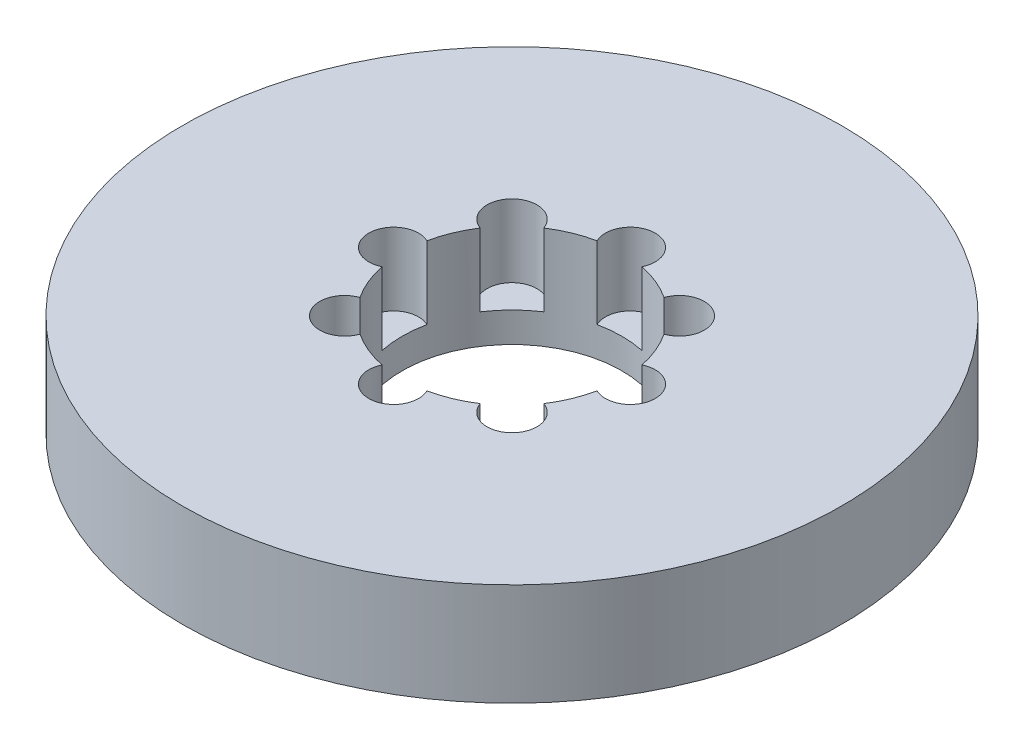
ISO-10303-21;
HEADER;
FILE_DESCRIPTION(('STEP AP214'),'2;1');
FILE_NAME('part.step','',(''),(''),'','','');
FILE_SCHEMA(('AUTOMOTIVE_DESIGN { 1 0 10303 214 1 1 1 1 }'));
ENDSEC;
DATA;
#1=APPLICATION_CONTEXT('core data for automotive mechanical design processes');
#2=APPLICATION_PROTOCOL_DEFINITION('international standard','automotive_design',2000,#1);
#3=PRODUCT_CONTEXT('',#1,'mechanical');
#4=PRODUCT('Part','Part','',(#3));
#5=PRODUCT_RELATED_PRODUCT_CATEGORY('part','',(#4));
#6=PRODUCT_DEFINITION_FORMATION('','',#4);
#7=PRODUCT_DEFINITION_CONTEXT('part definition',#1,'design');
#8=PRODUCT_DEFINITION('design','',#6,#7);
#9=PRODUCT_DEFINITION_SHAPE('','',#8);
#10=(LENGTH_UNIT() NAMED_UNIT(*) SI_UNIT(.MILLI.,.METRE.));
#11=(NAMED_UNIT(*) PLANE_ANGLE_UNIT() SI_UNIT($,.RADIAN.));
#12=(NAMED_UNIT(*) SI_UNIT($,.STERADIAN.) SOLID_ANGLE_UNIT());
#13=UNCERTAINTY_MEASURE_WITH_UNIT(LENGTH_MEASURE(1.E-05),#10,'distance_accuracy_value','');
#14=(GEOMETRIC_REPRESENTATION_CONTEXT(3) GLOBAL_UNCERTAINTY_ASSIGNED_CONTEXT((#13)) GLOBAL_UNIT_ASSIGNED_CONTEXT((#10,
#11,#12)) REPRESENTATION_CONTEXT('',''));
#15=CARTESIAN_POINT('',(0.,0.,0.));
#16=DIRECTION('',(0.,0.,1.));
#17=DIRECTION('',(1.,0.,0.));
#18=AXIS2_PLACEMENT_3D('',#15,#16,#17);
#19=CARTESIAN_POINT('',(0.,28.,0.));
#20=DIRECTION('',(0.,-1.,0.));
#21=DIRECTION('',(0.,0.,-1.));
#22=AXIS2_PLACEMENT_3D('',#19,#20,#21);
#23=CYLINDRICAL_SURFACE('',#22,90.);
#24=CARTESIAN_POINT('',(0.,28.,0.));
#25=DIRECTION('',(0.,1.,0.));
#26=DIRECTION('',(0.,0.,1.));
#27=AXIS2_PLACEMENT_3D('',#24,#25,#26);
#28=CIRCLE('',#27,90.);
#29=CARTESIAN_POINT('',(0.,28.,90.));
#30=VERTEX_POINT('',#29);
#31=EDGE_CURVE('E195',#30,#30,#28,.T.);
#32=ORIENTED_EDGE('',*,*,#31,.F.);
#33=EDGE_LOOP('',(#32));
#34=FACE_BOUND('',#33,.T.);
#35=CARTESIAN_POINT('',(0.,0.,0.));
#36=DIRECTION('',(0.,1.,0.));
#37=DIRECTION('',(0.,0.,1.));
#38=AXIS2_PLACEMENT_3D('',#35,#36,#37);
#39=CIRCLE('',#38,90.);
#40=CARTESIAN_POINT('',(0.,0.,90.));
#41=VERTEX_POINT('',#40);
#42=EDGE_CURVE('E179',#41,#41,#39,.T.);
#43=ORIENTED_EDGE('',*,*,#42,.T.);
#44=EDGE_LOOP('',(#43));
#45=FACE_BOUND('',#44,.T.);
#46=ADVANCED_FACE('F39',(#34,#45),#23,.T.);
#47=CARTESIAN_POINT('',(0.,28.,0.));
#48=DIRECTION('',(0.,1.,0.));
#49=DIRECTION('',(0.,0.,1.));
#50=AXIS2_PLACEMENT_3D('',#47,#48,#49);
#51=PLANE('',#50);
#52=CARTESIAN_POINT('',(1.12819682077759E-13,28.,32.3128412065752));
#53=DIRECTION('',(0.,1.,0.));
#54=DIRECTION('',(1.,0.,0.));
#55=AXIS2_PLACEMENT_3D('',#52,#53,#54);
#56=CIRCLE('',#55,6.80914139712923);
#57=CARTESIAN_POINT('',(-6.13813148406633,28.,29.3653425296609));
#58=VERTEX_POINT('',#57);
#59=CARTESIAN_POINT('',(6.13813148406654,28.,29.3653425296609));
#60=VERTEX_POINT('',#59);
#61=EDGE_CURVE('E176',#58,#60,#56,.T.);
#62=ORIENTED_EDGE('',*,*,#61,.F.);
#63=CARTESIAN_POINT('',(0.,28.,0.));
#64=DIRECTION('',(0.,1.,0.));
#65=DIRECTION('',(0.,0.,1.));
#66=AXIS2_PLACEMENT_3D('',#63,#64,#65);
#67=CIRCLE('',#66,30.);
#68=CARTESIAN_POINT('',(-16.4241184383909,28.,25.104747230787));
#69=VERTEX_POINT('',#68);
#70=EDGE_CURVE('E166',#69,#58,#67,.T.);
#71=ORIENTED_EDGE('',*,*,#70,.F.);
#72=CARTESIAN_POINT('',(-22.8486291365734,28.,22.8486291365735));
#73=DIRECTION('',(0.,1.,0.));
#74=DIRECTION('',(0.707106781186549,0.,0.707106781186546));
#75=AXIS2_PLACEMENT_3D('',#72,#73,#74);
#76=CIRCLE('',#75,6.80914139712923);
#77=CARTESIAN_POINT('',(-25.104747230787,28.,16.424118438391));
#78=VERTEX_POINT('',#77);
#79=EDGE_CURVE('E147',#78,#69,#76,.T.);
#80=ORIENTED_EDGE('',*,*,#79,.F.);
#81=CARTESIAN_POINT('',(-29.3653425296609,28.,6.13813148406643));
#82=VERTEX_POINT('',#81);
#83=EDGE_CURVE('E180',#82,#78,#67,.T.);
#84=ORIENTED_EDGE('',*,*,#83,.F.);
#85=CARTESIAN_POINT('',(-32.3128412065752,28.,0.));
#86=DIRECTION('',(0.,1.,0.));
#87=DIRECTION('',(0.,0.,1.));
#88=AXIS2_PLACEMENT_3D('',#85,#86,#87);
#89=CIRCLE('',#88,6.80914139712923);
#90=CARTESIAN_POINT('',(-29.3653425296609,28.,-6.13813148406643));
#91=VERTEX_POINT('',#90);
#92=EDGE_CURVE('E186',#91,#82,#89,.T.);
#93=ORIENTED_EDGE('',*,*,#92,.F.);
#94=CARTESIAN_POINT('',(-25.1047472307872,28.,-16.4241184383906));
#95=VERTEX_POINT('',#94);
#96=EDGE_CURVE('E182',#95,#91,#67,.T.);
#97=ORIENTED_EDGE('',*,*,#96,.F.);
#98=CARTESIAN_POINT('',(-22.8486291365737,28.,-22.8486291365731));
#99=DIRECTION('',(0.,1.,0.));
#100=DIRECTION('',(-0.707106781186539,0.,0.707106781186556));
#101=AXIS2_PLACEMENT_3D('',#98,#99,#100);
#102=CIRCLE('',#101,6.80914139712923);
#103=CARTESIAN_POINT('',(-16.4241184383912,28.,-25.1047472307868));
#104=VERTEX_POINT('',#103);
#105=EDGE_CURVE('E446',#104,#95,#102,.T.);
#106=ORIENTED_EDGE('',*,*,#105,.F.);
#107=CARTESIAN_POINT('',(-6.13813148406674,28.,-29.3653425296609));
#108=VERTEX_POINT('',#107);
#109=EDGE_CURVE('E452',#108,#104,#67,.T.);
#110=ORIENTED_EDGE('',*,*,#109,.F.);
#111=CARTESIAN_POINT('',(-3.38459046233276E-13,28.,-32.3128412065752));
#112=DIRECTION('',(0.,1.,0.));
#113=DIRECTION('',(-1.,0.,0.));
#114=AXIS2_PLACEMENT_3D('',#111,#112,#113);
#115=CIRCLE('',#114,6.80914139712923);
#116=CARTESIAN_POINT('',(6.13813148406613,28.,-29.365342529661));
#117=VERTEX_POINT('',#116);
#118=EDGE_CURVE('E477',#117,#108,#115,.T.);
#119=ORIENTED_EDGE('',*,*,#118,.F.);
#120=CARTESIAN_POINT('',(16.4241184383907,28.,-25.1047472307871));
#121=VERTEX_POINT('',#120);
#122=EDGE_CURVE('E460',#121,#117,#67,.T.);
#123=ORIENTED_EDGE('',*,*,#122,.F.);
#124=CARTESIAN_POINT('',(22.8486291365732,28.,-22.8486291365736));
#125=DIRECTION('',(0.,1.,0.));
#126=DIRECTION('',(-0.707106781186554,0.,-0.707106781186541));
#127=AXIS2_PLACEMENT_3D('',#124,#125,#126);
#128=CIRCLE('',#127,6.80914139712923);
#129=CARTESIAN_POINT('',(25.1047472307868,28.,-16.4241184383912));
#130=VERTEX_POINT('',#129);
#131=EDGE_CURVE('E464',#130,#121,#128,.T.);
#132=ORIENTED_EDGE('',*,*,#131,.F.);
#133=CARTESIAN_POINT('',(29.3653425296609,28.,-6.13813148406643));
#134=VERTEX_POINT('',#133);
#135=EDGE_CURVE('E459',#134,#130,#67,.T.);
#136=ORIENTED_EDGE('',*,*,#135,.F.);
#137=CARTESIAN_POINT('',(32.3128412065752,28.,0.));
#138=DIRECTION('',(0.,1.,0.));
#139=DIRECTION('',(0.,0.,-1.));
#140=AXIS2_PLACEMENT_3D('',#137,#138,#139);
#141=CIRCLE('',#140,6.80914139712923);
#142=CARTESIAN_POINT('',(29.3653425296609,28.,6.13813148406643));
#143=VERTEX_POINT('',#142);
#144=EDGE_CURVE('E469',#143,#134,#141,.T.);
#145=ORIENTED_EDGE('',*,*,#144,.F.);
#146=CARTESIAN_POINT('',(25.1047472307871,28.,16.4241184383908));
#147=VERTEX_POINT('',#146);
#148=EDGE_CURVE('E181',#147,#143,#67,.T.);
#149=ORIENTED_EDGE('',*,*,#148,.F.);
#150=CARTESIAN_POINT('',(22.8486291365735,28.,22.8486291365733));
#151=DIRECTION('',(0.,1.,0.));
#152=DIRECTION('',(0.707106781186544,0.,-0.707106781186551));
#153=AXIS2_PLACEMENT_3D('',#150,#151,#152);
#154=CIRCLE('',#153,6.80914139712923);
#155=CARTESIAN_POINT('',(16.4241184383911,28.,25.1047472307869));
#156=VERTEX_POINT('',#155);
#157=EDGE_CURVE('E475',#156,#147,#154,.T.);
#158=ORIENTED_EDGE('',*,*,#157,.F.);
#159=EDGE_CURVE('E177',#60,#156,#67,.T.);
#160=ORIENTED_EDGE('',*,*,#159,.F.);
#161=EDGE_LOOP('',(#62,#71,#80,#84,#93,#97,#106,#110,#119,#123,#132,#136,#145,#149,#158,#160));
#162=FACE_BOUND('',#161,.T.);
#163=ORIENTED_EDGE('',*,*,#31,.T.);
#164=EDGE_LOOP('',(#163));
#165=FACE_BOUND('',#164,.T.);
#166=ADVANCED_FACE('F172',(#162,#165),#51,.T.);
#167=CARTESIAN_POINT('',(0.,0.,0.));
#168=DIRECTION('',(0.,1.,0.));
#169=DIRECTION('',(0.,0.,1.));
#170=AXIS2_PLACEMENT_3D('',#167,#168,#169);
#171=PLANE('',#170);
#172=CARTESIAN_POINT('',(0.,0.,0.));
#173=DIRECTION('',(0.,1.,0.));
#174=DIRECTION('',(0.,0.,1.));
#175=AXIS2_PLACEMENT_3D('',#172,#173,#174);
#176=CIRCLE('',#175,30.);
#177=CARTESIAN_POINT('',(0.,0.,30.));
#178=VERTEX_POINT('',#177);
#179=EDGE_CURVE('E187',#178,#178,#176,.T.);
#180=ORIENTED_EDGE('',*,*,#179,.T.);
#181=EDGE_LOOP('',(#180));
#182=FACE_BOUND('',#181,.T.);
#183=ORIENTED_EDGE('',*,*,#42,.F.);
#184=EDGE_LOOP('',(#183));
#185=FACE_BOUND('',#184,.T.);
#186=ADVANCED_FACE('F270',(#182,#185),#171,.F.);
#187=CARTESIAN_POINT('',(0.,28.,0.));
#188=DIRECTION('',(0.,-1.,0.));
#189=DIRECTION('',(0.,0.,-1.));
#190=AXIS2_PLACEMENT_3D('',#187,#188,#189);
#191=CYLINDRICAL_SURFACE('',#190,30.);
#192=DIRECTION('',(0.,1.,0.));
#193=VECTOR('',#192,1.);
#194=CARTESIAN_POINT('',(-6.13813148406633,18.0872458032256,29.3653425296609));
#195=LINE('',#194,#193);
#196=CARTESIAN_POINT('',(-6.13813148406633,8.17449160645118,29.3653425296609));
#197=VERTEX_POINT('',#196);
#198=EDGE_CURVE('E11',#197,#58,#195,.T.);
#199=ORIENTED_EDGE('',*,*,#198,.F.);
#200=CARTESIAN_POINT('',(0.,8.17449160645118,0.));
#201=DIRECTION('',(0.,1.,0.));
#202=DIRECTION('',(0.,0.,1.));
#203=AXIS2_PLACEMENT_3D('',#200,#201,#202);
#204=CIRCLE('',#203,30.);
#205=CARTESIAN_POINT('',(6.13813148406654,8.17449160645118,29.3653425296609));
#206=VERTEX_POINT('',#205);
#207=EDGE_CURVE('E250',#197,#206,#204,.T.);
#208=ORIENTED_EDGE('',*,*,#207,.T.);
#209=DIRECTION('',(0.,1.,0.));
#210=VECTOR('',#209,1.);
#211=CARTESIAN_POINT('',(6.13813148406654,18.0872458032256,29.3653425296609));
#212=LINE('',#211,#210);
#213=EDGE_CURVE('E46',#60,#206,#212,.F.);
#214=ORIENTED_EDGE('',*,*,#213,.F.);
#215=ORIENTED_EDGE('',*,*,#159,.T.);
#216=DIRECTION('',(0.,1.,0.));
#217=VECTOR('',#216,1.);
#218=CARTESIAN_POINT('',(16.4241184383911,18.0872458032256,25.1047472307869));
#219=LINE('',#218,#217);
#220=CARTESIAN_POINT('',(16.4241184383911,8.17449160645118,25.1047472307869));
#221=VERTEX_POINT('',#220);
#222=EDGE_CURVE('E244',#221,#156,#219,.T.);
#223=ORIENTED_EDGE('',*,*,#222,.F.);
#224=CARTESIAN_POINT('',(0.,8.17449160645118,0.));
#225=DIRECTION('',(0.,1.,0.));
#226=DIRECTION('',(0.,0.,1.));
#227=AXIS2_PLACEMENT_3D('',#224,#225,#226);
#228=CIRCLE('',#227,30.);
#229=CARTESIAN_POINT('',(25.1047472307871,8.17449160645118,16.4241184383908));
#230=VERTEX_POINT('',#229);
#231=EDGE_CURVE('E238',#221,#230,#228,.T.);
#232=ORIENTED_EDGE('',*,*,#231,.T.);
#233=DIRECTION('',(0.,1.,0.));
#234=VECTOR('',#233,1.);
#235=CARTESIAN_POINT('',(25.1047472307871,18.0872458032256,16.4241184383908));
#236=LINE('',#235,#234);
#237=EDGE_CURVE('E242',#147,#230,#236,.F.);
#238=ORIENTED_EDGE('',*,*,#237,.F.);
#239=ORIENTED_EDGE('',*,*,#148,.T.);
#240=DIRECTION('',(0.,1.,0.));
#241=VECTOR('',#240,1.);
#242=CARTESIAN_POINT('',(29.3653425296609,18.0872458032256,6.13813148406644));
#243=LINE('',#242,#241);
#244=CARTESIAN_POINT('',(29.3653425296609,8.17449160645118,6.13813148406643));
#245=VERTEX_POINT('',#244);
#246=EDGE_CURVE('E236',#245,#143,#243,.T.);
#247=ORIENTED_EDGE('',*,*,#246,.F.);
#248=CARTESIAN_POINT('',(0.,8.17449160645118,0.));
#249=DIRECTION('',(0.,1.,0.));
#250=DIRECTION('',(0.,0.,1.));
#251=AXIS2_PLACEMENT_3D('',#248,#249,#250);
#252=CIRCLE('',#251,30.);
#253=CARTESIAN_POINT('',(29.3653425296609,8.17449160645118,-6.13813148406643));
#254=VERTEX_POINT('',#253);
#255=EDGE_CURVE('E235',#245,#254,#252,.T.);
#256=ORIENTED_EDGE('',*,*,#255,.T.);
#257=DIRECTION('',(0.,1.,0.));
#258=VECTOR('',#257,1.);
#259=CARTESIAN_POINT('',(29.3653425296609,18.0872458032256,-6.13813148406644));
#260=LINE('',#259,#258);
#261=EDGE_CURVE('E234',#134,#254,#260,.F.);
#262=ORIENTED_EDGE('',*,*,#261,.F.);
#263=ORIENTED_EDGE('',*,*,#135,.T.);
#264=DIRECTION('',(0.,1.,0.));
#265=VECTOR('',#264,1.);
#266=CARTESIAN_POINT('',(25.1047472307868,18.0872458032256,-16.4241184383912));
#267=LINE('',#266,#265);
#268=CARTESIAN_POINT('',(25.1047472307868,8.17449160645118,-16.4241184383912));
#269=VERTEX_POINT('',#268);
#270=EDGE_CURVE('E229',#269,#130,#267,.T.);
#271=ORIENTED_EDGE('',*,*,#270,.F.);
#272=CARTESIAN_POINT('',(0.,8.17449160645118,0.));
#273=DIRECTION('',(0.,1.,0.));
#274=DIRECTION('',(0.,0.,1.));
#275=AXIS2_PLACEMENT_3D('',#272,#273,#274);
#276=CIRCLE('',#275,30.);
#277=CARTESIAN_POINT('',(16.4241184383907,8.17449160645118,-25.1047472307871));
#278=VERTEX_POINT('',#277);
#279=EDGE_CURVE('E221',#269,#278,#276,.T.);
#280=ORIENTED_EDGE('',*,*,#279,.T.);
#281=DIRECTION('',(0.,1.,0.));
#282=VECTOR('',#281,1.);
#283=CARTESIAN_POINT('',(16.4241184383907,18.0872458032256,-25.1047472307871));
#284=LINE('',#283,#282);
#285=EDGE_CURVE('E230',#121,#278,#284,.F.);
#286=ORIENTED_EDGE('',*,*,#285,.F.);
#287=ORIENTED_EDGE('',*,*,#122,.T.);
#288=DIRECTION('',(0.,1.,0.));
#289=VECTOR('',#288,1.);
#290=CARTESIAN_POINT('',(6.13813148406613,18.0872458032256,-29.365342529661));
#291=LINE('',#290,#289);
#292=CARTESIAN_POINT('',(6.13813148406613,8.17449160645118,-29.365342529661));
#293=VERTEX_POINT('',#292);
#294=EDGE_CURVE('E225',#293,#117,#291,.T.);
#295=ORIENTED_EDGE('',*,*,#294,.F.);
#296=CARTESIAN_POINT('',(0.,8.17449160645118,0.));
#297=DIRECTION('',(0.,1.,0.));
#298=DIRECTION('',(0.,0.,1.));
#299=AXIS2_PLACEMENT_3D('',#296,#297,#298);
#300=CIRCLE('',#299,30.);
#301=CARTESIAN_POINT('',(-6.13813148406674,8.17449160645118,-29.3653425296609));
#302=VERTEX_POINT('',#301);
#303=EDGE_CURVE('E216',#293,#302,#300,.T.);
#304=ORIENTED_EDGE('',*,*,#303,.T.);
#305=DIRECTION('',(0.,1.,0.));
#306=VECTOR('',#305,1.);
#307=CARTESIAN_POINT('',(-6.13813148406674,18.0872458032256,-29.3653425296609));
#308=LINE('',#307,#306);
#309=EDGE_CURVE('E218',#108,#302,#308,.F.);
#310=ORIENTED_EDGE('',*,*,#309,.F.);
#311=ORIENTED_EDGE('',*,*,#109,.T.);
#312=DIRECTION('',(0.,1.,0.));
#313=VECTOR('',#312,1.);
#314=CARTESIAN_POINT('',(-16.4241184383912,18.0872458032256,-25.1047472307868));
#315=LINE('',#314,#313);
#316=CARTESIAN_POINT('',(-16.4241184383912,8.17449160645118,-25.1047472307868));
#317=VERTEX_POINT('',#316);
#318=EDGE_CURVE('E212',#317,#104,#315,.T.);
#319=ORIENTED_EDGE('',*,*,#318,.F.);
#320=CARTESIAN_POINT('',(0.,8.17449160645118,0.));
#321=DIRECTION('',(0.,1.,0.));
#322=DIRECTION('',(0.,0.,1.));
#323=AXIS2_PLACEMENT_3D('',#320,#321,#322);
#324=CIRCLE('',#323,30.);
#325=CARTESIAN_POINT('',(-25.1047472307872,8.17449160645118,-16.4241184383906));
#326=VERTEX_POINT('',#325);
#327=EDGE_CURVE('E208',#317,#326,#324,.T.);
#328=ORIENTED_EDGE('',*,*,#327,.T.);
#329=DIRECTION('',(0.,1.,0.));
#330=VECTOR('',#329,1.);
#331=CARTESIAN_POINT('',(-25.1047472307872,18.0872458032256,-16.4241184383906));
#332=LINE('',#331,#330);
#333=EDGE_CURVE('E211',#95,#326,#332,.F.);
#334=ORIENTED_EDGE('',*,*,#333,.F.);
#335=ORIENTED_EDGE('',*,*,#96,.T.);
#336=DIRECTION('',(0.,1.,0.));
#337=VECTOR('',#336,1.);
#338=CARTESIAN_POINT('',(-29.3653425296609,18.0872458032256,-6.13813148406644));
#339=LINE('',#338,#337);
#340=CARTESIAN_POINT('',(-29.3653425296609,8.17449160645118,-6.13813148406643));
#341=VERTEX_POINT('',#340);
#342=EDGE_CURVE('E201',#341,#91,#339,.T.);
#343=ORIENTED_EDGE('',*,*,#342,.F.);
#344=CARTESIAN_POINT('',(0.,8.17449160645118,0.));
#345=DIRECTION('',(0.,1.,0.));
#346=DIRECTION('',(0.,0.,1.));
#347=AXIS2_PLACEMENT_3D('',#344,#345,#346);
#348=CIRCLE('',#347,30.);
#349=CARTESIAN_POINT('',(-29.3653425296609,8.17449160645118,6.13813148406643));
#350=VERTEX_POINT('',#349);
#351=EDGE_CURVE('E194',#341,#350,#348,.T.);
#352=ORIENTED_EDGE('',*,*,#351,.T.);
#353=DIRECTION('',(0.,1.,0.));
#354=VECTOR('',#353,1.);
#355=CARTESIAN_POINT('',(-29.3653425296609,18.0872458032256,6.13813148406644));
#356=LINE('',#355,#354);
#357=EDGE_CURVE('E199',#82,#350,#356,.F.);
#358=ORIENTED_EDGE('',*,*,#357,.F.);
#359=ORIENTED_EDGE('',*,*,#83,.T.);
#360=DIRECTION('',(0.,1.,0.));
#361=VECTOR('',#360,1.);
#362=CARTESIAN_POINT('',(-25.104747230787,18.0872458032256,16.424118438391));
#363=LINE('',#362,#361);
#364=CARTESIAN_POINT('',(-25.104747230787,8.17449160645118,16.424118438391));
#365=VERTEX_POINT('',#364);
#366=EDGE_CURVE('E160',#365,#78,#363,.T.);
#367=ORIENTED_EDGE('',*,*,#366,.F.);
#368=CARTESIAN_POINT('',(0.,8.17449160645118,0.));
#369=DIRECTION('',(0.,1.,0.));
#370=DIRECTION('',(0.,0.,1.));
#371=AXIS2_PLACEMENT_3D('',#368,#369,#370);
#372=CIRCLE('',#371,30.);
#373=CARTESIAN_POINT('',(-16.4241184383909,8.17449160645118,25.104747230787));
#374=VERTEX_POINT('',#373);
#375=EDGE_CURVE('E168',#365,#374,#372,.T.);
#376=ORIENTED_EDGE('',*,*,#375,.T.);
#377=DIRECTION('',(0.,1.,0.));
#378=VECTOR('',#377,1.);
#379=CARTESIAN_POINT('',(-16.4241184383909,18.0872458032256,25.104747230787));
#380=LINE('',#379,#378);
#381=EDGE_CURVE('E152',#69,#374,#380,.F.);
#382=ORIENTED_EDGE('',*,*,#381,.F.);
#383=ORIENTED_EDGE('',*,*,#70,.T.);
#384=EDGE_LOOP('',(#199,#208,#214,#215,#223,#232,#238,#239,#247,#256,#262,#263,#271,#280,#286,
#287,#295,#304,#310,#311,#319,#328,#334,#335,#343,#352,#358,#359,#367,#376,#382,#383));
#385=FACE_BOUND('',#384,.T.);
#386=ORIENTED_EDGE('',*,*,#179,.F.);
#387=EDGE_LOOP('',(#386));
#388=FACE_BOUND('',#387,.T.);
#389=ADVANCED_FACE('F170',(#385,#388),#191,.F.);
#390=CARTESIAN_POINT('',(-32.3128412065752,8.17449160645118,0.));
#391=DIRECTION('',(0.,1.,0.));
#392=DIRECTION('',(0.,0.,1.));
#393=AXIS2_PLACEMENT_3D('',#390,#391,#392);
#394=CYLINDRICAL_SURFACE('',#393,6.80914139712923);
#395=ORIENTED_EDGE('',*,*,#342,.T.);
#396=ORIENTED_EDGE('',*,*,#92,.T.);
#397=ORIENTED_EDGE('',*,*,#357,.T.);
#398=CARTESIAN_POINT('',(-32.3128412065752,8.17449160645118,0.));
#399=DIRECTION('',(0.,1.,0.));
#400=DIRECTION('',(0.,0.,1.));
#401=AXIS2_PLACEMENT_3D('',#398,#399,#400);
#402=CIRCLE('',#401,6.80914139712923);
#403=EDGE_CURVE('E191',#341,#350,#402,.T.);
#404=ORIENTED_EDGE('',*,*,#403,.F.);
#405=EDGE_LOOP('',(#395,#396,#397,#404));
#406=FACE_BOUND('',#405,.T.);
#407=ADVANCED_FACE('F279',(#406),#394,.F.);
#408=CARTESIAN_POINT('',(-32.3128412065752,8.17449160645118,0.));
#409=DIRECTION('',(0.,1.,0.));
#410=DIRECTION('',(0.,0.,1.));
#411=AXIS2_PLACEMENT_3D('',#408,#409,#410);
#412=PLANE('',#411);
#413=ORIENTED_EDGE('',*,*,#403,.T.);
#414=ORIENTED_EDGE('',*,*,#351,.F.);
#415=EDGE_LOOP('',(#413,#414));
#416=FACE_BOUND('',#415,.T.);
#417=ADVANCED_FACE('F285',(#416),#412,.T.);
#418=CARTESIAN_POINT('',(-22.8486291365734,8.17449160645118,22.8486291365735));
#419=DIRECTION('',(0.,1.,0.));
#420=DIRECTION('',(0.,0.,1.));
#421=AXIS2_PLACEMENT_3D('',#418,#419,#420);
#422=CYLINDRICAL_SURFACE('',#421,6.80914139712923);
#423=ORIENTED_EDGE('',*,*,#366,.T.);
#424=ORIENTED_EDGE('',*,*,#79,.T.);
#425=ORIENTED_EDGE('',*,*,#381,.T.);
#426=CARTESIAN_POINT('',(-22.8486291365734,8.17449160645118,22.8486291365735));
#427=DIRECTION('',(0.,1.,0.));
#428=DIRECTION('',(0.707106781186549,0.,0.707106781186546));
#429=AXIS2_PLACEMENT_3D('',#426,#427,#428);
#430=CIRCLE('',#429,6.80914139712923);
#431=EDGE_CURVE('E165',#365,#374,#430,.T.);
#432=ORIENTED_EDGE('',*,*,#431,.F.);
#433=EDGE_LOOP('',(#423,#424,#425,#432));
#434=FACE_BOUND('',#433,.T.);
#435=ADVANCED_FACE('F155',(#434),#422,.F.);
#436=CARTESIAN_POINT('',(-22.8486291365734,8.17449160645118,22.8486291365735));
#437=DIRECTION('',(0.,1.,0.));
#438=DIRECTION('',(0.707106781186549,0.,0.707106781186546));
#439=AXIS2_PLACEMENT_3D('',#436,#437,#438);
#440=PLANE('',#439);
#441=ORIENTED_EDGE('',*,*,#431,.T.);
#442=ORIENTED_EDGE('',*,*,#375,.F.);
#443=EDGE_LOOP('',(#441,#442));
#444=FACE_BOUND('',#443,.T.);
#445=ADVANCED_FACE('F288',(#444),#440,.T.);
#446=CARTESIAN_POINT('',(-22.8486291365737,8.17449160645118,-22.8486291365731));
#447=DIRECTION('',(0.,1.,0.));
#448=DIRECTION('',(0.,0.,1.));
#449=AXIS2_PLACEMENT_3D('',#446,#447,#448);
#450=CYLINDRICAL_SURFACE('',#449,6.80914139712923);
#451=ORIENTED_EDGE('',*,*,#318,.T.);
#452=ORIENTED_EDGE('',*,*,#105,.T.);
#453=ORIENTED_EDGE('',*,*,#333,.T.);
#454=CARTESIAN_POINT('',(-22.8486291365737,8.17449160645118,-22.8486291365731));
#455=DIRECTION('',(0.,1.,0.));
#456=DIRECTION('',(-0.707106781186539,0.,0.707106781186556));
#457=AXIS2_PLACEMENT_3D('',#454,#455,#456);
#458=CIRCLE('',#457,6.80914139712923);
#459=EDGE_CURVE('E447',#317,#326,#458,.T.);
#460=ORIENTED_EDGE('',*,*,#459,.F.);
#461=EDGE_LOOP('',(#451,#452,#453,#460));
#462=FACE_BOUND('',#461,.T.);
#463=ADVANCED_FACE('F295',(#462),#450,.F.);
#464=CARTESIAN_POINT('',(-22.8486291365737,8.17449160645118,-22.8486291365731));
#465=DIRECTION('',(0.,1.,0.));
#466=DIRECTION('',(-0.707106781186539,0.,0.707106781186556));
#467=AXIS2_PLACEMENT_3D('',#464,#465,#466);
#468=PLANE('',#467);
#469=ORIENTED_EDGE('',*,*,#459,.T.);
#470=ORIENTED_EDGE('',*,*,#327,.F.);
#471=EDGE_LOOP('',(#469,#470));
#472=FACE_BOUND('',#471,.T.);
#473=ADVANCED_FACE('F375',(#472),#468,.T.);
#474=CARTESIAN_POINT('',(-3.38459046233276E-13,8.17449160645118,-32.3128412065752));
#475=DIRECTION('',(0.,1.,0.));
#476=DIRECTION('',(0.,0.,1.));
#477=AXIS2_PLACEMENT_3D('',#474,#475,#476);
#478=CYLINDRICAL_SURFACE('',#477,6.80914139712923);
#479=ORIENTED_EDGE('',*,*,#294,.T.);
#480=ORIENTED_EDGE('',*,*,#118,.T.);
#481=ORIENTED_EDGE('',*,*,#309,.T.);
#482=CARTESIAN_POINT('',(-3.38459046233276E-13,8.17449160645118,-32.3128412065752));
#483=DIRECTION('',(0.,1.,0.));
#484=DIRECTION('',(-1.,0.,0.));
#485=AXIS2_PLACEMENT_3D('',#482,#483,#484);
#486=CIRCLE('',#485,6.80914139712923);
#487=EDGE_CURVE('E467',#293,#302,#486,.T.);
#488=ORIENTED_EDGE('',*,*,#487,.F.);
#489=EDGE_LOOP('',(#479,#480,#481,#488));
#490=FACE_BOUND('',#489,.T.);
#491=ADVANCED_FACE('F361',(#490),#478,.F.);
#492=CARTESIAN_POINT('',(-3.38459046233276E-13,8.17449160645118,-32.3128412065752));
#493=DIRECTION('',(0.,1.,0.));
#494=DIRECTION('',(-1.,0.,0.));
#495=AXIS2_PLACEMENT_3D('',#492,#493,#494);
#496=PLANE('',#495);
#497=ORIENTED_EDGE('',*,*,#487,.T.);
#498=ORIENTED_EDGE('',*,*,#303,.F.);
#499=EDGE_LOOP('',(#497,#498));
#500=FACE_BOUND('',#499,.T.);
#501=ADVANCED_FACE('F297',(#500),#496,.T.);
#502=CARTESIAN_POINT('',(22.8486291365732,8.17449160645118,-22.8486291365736));
#503=DIRECTION('',(0.,1.,0.));
#504=DIRECTION('',(0.,0.,1.));
#505=AXIS2_PLACEMENT_3D('',#502,#503,#504);
#506=CYLINDRICAL_SURFACE('',#505,6.80914139712923);
#507=ORIENTED_EDGE('',*,*,#270,.T.);
#508=ORIENTED_EDGE('',*,*,#131,.T.);
#509=ORIENTED_EDGE('',*,*,#285,.T.);
#510=CARTESIAN_POINT('',(22.8486291365732,8.17449160645118,-22.8486291365736));
#511=DIRECTION('',(0.,1.,0.));
#512=DIRECTION('',(-0.707106781186554,0.,-0.707106781186541));
#513=AXIS2_PLACEMENT_3D('',#510,#511,#512);
#514=CIRCLE('',#513,6.80914139712923);
#515=EDGE_CURVE('E470',#269,#278,#514,.T.);
#516=ORIENTED_EDGE('',*,*,#515,.F.);
#517=EDGE_LOOP('',(#507,#508,#509,#516));
#518=FACE_BOUND('',#517,.T.);
#519=ADVANCED_FACE('F294',(#518),#506,.F.);
#520=CARTESIAN_POINT('',(22.8486291365732,8.17449160645118,-22.8486291365736));
#521=DIRECTION('',(0.,1.,0.));
#522=DIRECTION('',(-0.707106781186554,0.,-0.707106781186541));
#523=AXIS2_PLACEMENT_3D('',#520,#521,#522);
#524=PLANE('',#523);
#525=ORIENTED_EDGE('',*,*,#515,.T.);
#526=ORIENTED_EDGE('',*,*,#279,.F.);
#527=EDGE_LOOP('',(#525,#526));
#528=FACE_BOUND('',#527,.T.);
#529=ADVANCED_FACE('F300',(#528),#524,.T.);
#530=CARTESIAN_POINT('',(32.3128412065752,8.17449160645118,0.));
#531=DIRECTION('',(0.,1.,0.));
#532=DIRECTION('',(0.,0.,1.));
#533=AXIS2_PLACEMENT_3D('',#530,#531,#532);
#534=CYLINDRICAL_SURFACE('',#533,6.80914139712923);
#535=ORIENTED_EDGE('',*,*,#246,.T.);
#536=ORIENTED_EDGE('',*,*,#144,.T.);
#537=ORIENTED_EDGE('',*,*,#261,.T.);
#538=CARTESIAN_POINT('',(32.3128412065752,8.17449160645118,0.));
#539=DIRECTION('',(0.,1.,0.));
#540=DIRECTION('',(0.,0.,-1.));
#541=AXIS2_PLACEMENT_3D('',#538,#539,#540);
#542=CIRCLE('',#541,6.80914139712923);
#543=EDGE_CURVE('E472',#245,#254,#542,.T.);
#544=ORIENTED_EDGE('',*,*,#543,.F.);
#545=EDGE_LOOP('',(#535,#536,#537,#544));
#546=FACE_BOUND('',#545,.T.);
#547=ADVANCED_FACE('F305',(#546),#534,.F.);
#548=CARTESIAN_POINT('',(32.3128412065752,8.17449160645118,0.));
#549=DIRECTION('',(0.,1.,0.));
#550=DIRECTION('',(0.,0.,-1.));
#551=AXIS2_PLACEMENT_3D('',#548,#549,#550);
#552=PLANE('',#551);
#553=ORIENTED_EDGE('',*,*,#543,.T.);
#554=ORIENTED_EDGE('',*,*,#255,.F.);
#555=EDGE_LOOP('',(#553,#554));
#556=FACE_BOUND('',#555,.T.);
#557=ADVANCED_FACE('F308',(#556),#552,.T.);
#558=CARTESIAN_POINT('',(22.8486291365735,8.17449160645118,22.8486291365733));
#559=DIRECTION('',(0.,1.,0.));
#560=DIRECTION('',(0.,0.,1.));
#561=AXIS2_PLACEMENT_3D('',#558,#559,#560);
#562=CYLINDRICAL_SURFACE('',#561,6.80914139712923);
#563=ORIENTED_EDGE('',*,*,#222,.T.);
#564=ORIENTED_EDGE('',*,*,#157,.T.);
#565=ORIENTED_EDGE('',*,*,#237,.T.);
#566=CARTESIAN_POINT('',(22.8486291365735,8.17449160645118,22.8486291365733));
#567=DIRECTION('',(0.,1.,0.));
#568=DIRECTION('',(0.707106781186544,0.,-0.707106781186551));
#569=AXIS2_PLACEMENT_3D('',#566,#567,#568);
#570=CIRCLE('',#569,6.80914139712923);
#571=EDGE_CURVE('E56',#221,#230,#570,.T.);
#572=ORIENTED_EDGE('',*,*,#571,.F.);
#573=EDGE_LOOP('',(#563,#564,#565,#572));
#574=FACE_BOUND('',#573,.T.);
#575=ADVANCED_FACE('F309',(#574),#562,.F.);
#576=CARTESIAN_POINT('',(22.8486291365735,8.17449160645118,22.8486291365733));
#577=DIRECTION('',(0.,1.,0.));
#578=DIRECTION('',(0.707106781186544,0.,-0.707106781186551));
#579=AXIS2_PLACEMENT_3D('',#576,#577,#578);
#580=PLANE('',#579);
#581=ORIENTED_EDGE('',*,*,#571,.T.);
#582=ORIENTED_EDGE('',*,*,#231,.F.);
#583=EDGE_LOOP('',(#581,#582));
#584=FACE_BOUND('',#583,.T.);
#585=ADVANCED_FACE('F256',(#584),#580,.T.);
#586=CARTESIAN_POINT('',(1.12819682077759E-13,8.17449160645118,32.3128412065752));
#587=DIRECTION('',(0.,1.,0.));
#588=DIRECTION('',(0.,0.,1.));
#589=AXIS2_PLACEMENT_3D('',#586,#587,#588);
#590=CYLINDRICAL_SURFACE('',#589,6.80914139712923);
#591=ORIENTED_EDGE('',*,*,#198,.T.);
#592=ORIENTED_EDGE('',*,*,#61,.T.);
#593=ORIENTED_EDGE('',*,*,#213,.T.);
#594=CARTESIAN_POINT('',(1.12819682077759E-13,8.17449160645118,32.3128412065752));
#595=DIRECTION('',(0.,1.,0.));
#596=DIRECTION('',(1.,0.,0.));
#597=AXIS2_PLACEMENT_3D('',#594,#595,#596);
#598=CIRCLE('',#597,6.80914139712923);
#599=EDGE_CURVE('E55',#197,#206,#598,.T.);
#600=ORIENTED_EDGE('',*,*,#599,.F.);
#601=EDGE_LOOP('',(#591,#592,#593,#600));
#602=FACE_BOUND('',#601,.T.);
#603=ADVANCED_FACE('F253',(#602),#590,.F.);
#604=CARTESIAN_POINT('',(1.12819682077759E-13,8.17449160645118,32.3128412065752));
#605=DIRECTION('',(0.,1.,0.));
#606=DIRECTION('',(1.,0.,0.));
#607=AXIS2_PLACEMENT_3D('',#604,#605,#606);
#608=PLANE('',#607);
#609=ORIENTED_EDGE('',*,*,#599,.T.);
#610=ORIENTED_EDGE('',*,*,#207,.F.);
#611=EDGE_LOOP('',(#609,#610));
#612=FACE_BOUND('',#611,.T.);
#613=ADVANCED_FACE('F252',(#612),#608,.T.);
#614=CLOSED_SHELL('',(#46,#166,#186,#389,#407,#417,#435,#445,#463,#473,#491,#501,#519,#529,#547,
#557,#575,#585,#603,#613));
#615=MANIFOLD_SOLID_BREP('B2',#614);
#616=ADVANCED_BREP_SHAPE_REPRESENTATION('',(#18,#615),#14);
#617=SHAPE_DEFINITION_REPRESENTATION(#9,#616);
ENDSEC;
END-ISO-10303-21;
